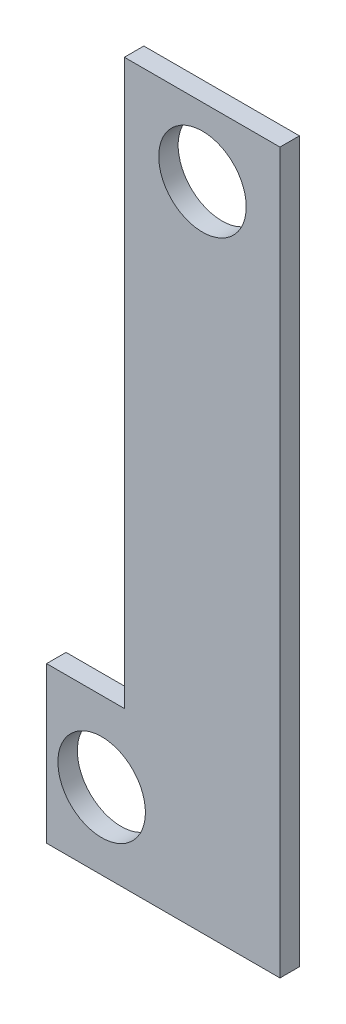
ISO-10303-21;
HEADER;
FILE_DESCRIPTION(('STEP AP214'),'2;1');
FILE_NAME('part.step','',(''),(''),'','','');
FILE_SCHEMA(('AUTOMOTIVE_DESIGN { 1 0 10303 214 1 1 1 1 }'));
ENDSEC;
DATA;
#1=APPLICATION_CONTEXT('core data for automotive mechanical design processes');
#2=APPLICATION_PROTOCOL_DEFINITION('international standard','automotive_design',2000,#1);
#3=PRODUCT_CONTEXT('',#1,'mechanical');
#4=PRODUCT('Part','Part','',(#3));
#5=PRODUCT_RELATED_PRODUCT_CATEGORY('part','',(#4));
#6=PRODUCT_DEFINITION_FORMATION('','',#4);
#7=PRODUCT_DEFINITION_CONTEXT('part definition',#1,'design');
#8=PRODUCT_DEFINITION('design','',#6,#7);
#9=PRODUCT_DEFINITION_SHAPE('','',#8);
#10=(LENGTH_UNIT() NAMED_UNIT(*) SI_UNIT(.MILLI.,.METRE.));
#11=(NAMED_UNIT(*) PLANE_ANGLE_UNIT() SI_UNIT($,.RADIAN.));
#12=(NAMED_UNIT(*) SI_UNIT($,.STERADIAN.) SOLID_ANGLE_UNIT());
#13=UNCERTAINTY_MEASURE_WITH_UNIT(LENGTH_MEASURE(1.E-05),#10,'distance_accuracy_value','');
#14=(GEOMETRIC_REPRESENTATION_CONTEXT(3) GLOBAL_UNCERTAINTY_ASSIGNED_CONTEXT((#13)) GLOBAL_UNIT_ASSIGNED_CONTEXT((#10,
#11,#12)) REPRESENTATION_CONTEXT('',''));
#15=CARTESIAN_POINT('',(0.,0.,0.));
#16=DIRECTION('',(0.,0.,1.));
#17=DIRECTION('',(1.,0.,0.));
#18=AXIS2_PLACEMENT_3D('',#15,#16,#17);
#19=CARTESIAN_POINT('',(76.2,0.,6.35));
#20=DIRECTION('',(-1.,0.,0.));
#21=DIRECTION('',(0.,0.,1.));
#22=AXIS2_PLACEMENT_3D('',#19,#20,#21);
#23=PLANE('',#22);
#24=DIRECTION('',(0.,1.,0.));
#25=VECTOR('',#24,1.);
#26=CARTESIAN_POINT('',(76.2,0.,0.));
#27=LINE('',#26,#25);
#28=CARTESIAN_POINT('',(76.2,0.,0.));
#29=VERTEX_POINT('',#28);
#30=CARTESIAN_POINT('',(76.2,234.95,0.));
#31=VERTEX_POINT('',#30);
#32=EDGE_CURVE('E125',#29,#31,#27,.T.);
#33=ORIENTED_EDGE('',*,*,#32,.T.);
#34=DIRECTION('',(0.,0.,-1.));
#35=VECTOR('',#34,1.);
#36=CARTESIAN_POINT('',(76.2,234.95,6.35));
#37=LINE('',#36,#35);
#38=CARTESIAN_POINT('',(76.2,234.95,6.35));
#39=VERTEX_POINT('',#38);
#40=EDGE_CURVE('E11',#39,#31,#37,.T.);
#41=ORIENTED_EDGE('',*,*,#40,.F.);
#42=DIRECTION('',(0.,1.,0.));
#43=VECTOR('',#42,1.);
#44=CARTESIAN_POINT('',(76.2,0.,6.35));
#45=LINE('',#44,#43);
#46=CARTESIAN_POINT('',(76.2,0.,6.35));
#47=VERTEX_POINT('',#46);
#48=EDGE_CURVE('E144',#47,#39,#45,.T.);
#49=ORIENTED_EDGE('',*,*,#48,.F.);
#50=DIRECTION('',(0.,0.,-1.));
#51=VECTOR('',#50,1.);
#52=CARTESIAN_POINT('',(76.2,0.,6.35));
#53=LINE('',#52,#51);
#54=EDGE_CURVE('E121',#47,#29,#53,.T.);
#55=ORIENTED_EDGE('',*,*,#54,.T.);
#56=EDGE_LOOP('',(#33,#41,#49,#55));
#57=FACE_BOUND('',#56,.T.);
#58=ADVANCED_FACE('F38',(#57),#23,.F.);
#59=CARTESIAN_POINT('',(76.2,234.95,6.35));
#60=DIRECTION('',(0.,-1.,0.));
#61=DIRECTION('',(0.,0.,-1.));
#62=AXIS2_PLACEMENT_3D('',#59,#60,#61);
#63=PLANE('',#62);
#64=DIRECTION('',(-1.,0.,0.));
#65=VECTOR('',#64,1.);
#66=CARTESIAN_POINT('',(76.2,234.95,0.));
#67=LINE('',#66,#65);
#68=CARTESIAN_POINT('',(25.4,234.95,0.));
#69=VERTEX_POINT('',#68);
#70=EDGE_CURVE('E129',#31,#69,#67,.T.);
#71=ORIENTED_EDGE('',*,*,#70,.T.);
#72=DIRECTION('',(0.,0.,-1.));
#73=VECTOR('',#72,1.);
#74=CARTESIAN_POINT('',(25.4,234.95,6.35));
#75=LINE('',#74,#73);
#76=CARTESIAN_POINT('',(25.4,234.95,6.35));
#77=VERTEX_POINT('',#76);
#78=EDGE_CURVE('E47',#77,#69,#75,.T.);
#79=ORIENTED_EDGE('',*,*,#78,.F.);
#80=DIRECTION('',(-1.,0.,0.));
#81=VECTOR('',#80,1.);
#82=CARTESIAN_POINT('',(76.2,234.95,6.35));
#83=LINE('',#82,#81);
#84=EDGE_CURVE('E88',#39,#77,#83,.T.);
#85=ORIENTED_EDGE('',*,*,#84,.F.);
#86=ORIENTED_EDGE('',*,*,#40,.T.);
#87=EDGE_LOOP('',(#71,#79,#85,#86));
#88=FACE_BOUND('',#87,.T.);
#89=ADVANCED_FACE('F174',(#88),#63,.F.);
#90=CARTESIAN_POINT('',(25.4,234.95,6.35));
#91=DIRECTION('',(1.,0.,0.));
#92=DIRECTION('',(0.,0.,-1.));
#93=AXIS2_PLACEMENT_3D('',#90,#91,#92);
#94=PLANE('',#93);
#95=DIRECTION('',(0.,-1.,0.));
#96=VECTOR('',#95,1.);
#97=CARTESIAN_POINT('',(25.4,234.95,0.));
#98=LINE('',#97,#96);
#99=CARTESIAN_POINT('',(25.4,50.8,0.));
#100=VERTEX_POINT('',#99);
#101=EDGE_CURVE('E133',#69,#100,#98,.T.);
#102=ORIENTED_EDGE('',*,*,#101,.T.);
#103=DIRECTION('',(0.,0.,-1.));
#104=VECTOR('',#103,1.);
#105=CARTESIAN_POINT('',(25.4,50.8,6.35));
#106=LINE('',#105,#104);
#107=CARTESIAN_POINT('',(25.4,50.8,6.35));
#108=VERTEX_POINT('',#107);
#109=EDGE_CURVE('E108',#108,#100,#106,.T.);
#110=ORIENTED_EDGE('',*,*,#109,.F.);
#111=DIRECTION('',(0.,-1.,0.));
#112=VECTOR('',#111,1.);
#113=CARTESIAN_POINT('',(25.4,234.95,6.35));
#114=LINE('',#113,#112);
#115=EDGE_CURVE('E113',#77,#108,#114,.T.);
#116=ORIENTED_EDGE('',*,*,#115,.F.);
#117=ORIENTED_EDGE('',*,*,#78,.T.);
#118=EDGE_LOOP('',(#102,#110,#116,#117));
#119=FACE_BOUND('',#118,.T.);
#120=ADVANCED_FACE('F154',(#119),#94,.F.);
#121=CARTESIAN_POINT('',(0.,50.8,6.35));
#122=DIRECTION('',(0.,1.,0.));
#123=DIRECTION('',(0.,0.,1.));
#124=AXIS2_PLACEMENT_3D('',#121,#122,#123);
#125=PLANE('',#124);
#126=DIRECTION('',(1.,0.,0.));
#127=VECTOR('',#126,1.);
#128=CARTESIAN_POINT('',(0.,50.8,0.));
#129=LINE('',#128,#127);
#130=CARTESIAN_POINT('',(0.,50.8,0.));
#131=VERTEX_POINT('',#130);
#132=EDGE_CURVE('E102',#131,#100,#129,.T.);
#133=ORIENTED_EDGE('',*,*,#132,.F.);
#134=DIRECTION('',(0.,0.,-1.));
#135=VECTOR('',#134,1.);
#136=CARTESIAN_POINT('',(0.,50.8,6.35));
#137=LINE('',#136,#135);
#138=CARTESIAN_POINT('',(0.,50.8,6.35));
#139=VERTEX_POINT('',#138);
#140=EDGE_CURVE('E97',#139,#131,#137,.T.);
#141=ORIENTED_EDGE('',*,*,#140,.F.);
#142=DIRECTION('',(1.,0.,0.));
#143=VECTOR('',#142,1.);
#144=CARTESIAN_POINT('',(0.,50.8,6.35));
#145=LINE('',#144,#143);
#146=EDGE_CURVE('E100',#139,#108,#145,.T.);
#147=ORIENTED_EDGE('',*,*,#146,.T.);
#148=ORIENTED_EDGE('',*,*,#109,.T.);
#149=EDGE_LOOP('',(#133,#141,#147,#148));
#150=FACE_BOUND('',#149,.T.);
#151=ADVANCED_FACE('F99',(#150),#125,.T.);
#152=CARTESIAN_POINT('',(0.,0.,6.35));
#153=DIRECTION('',(-1.,0.,0.));
#154=DIRECTION('',(0.,0.,1.));
#155=AXIS2_PLACEMENT_3D('',#152,#153,#154);
#156=PLANE('',#155);
#157=DIRECTION('',(0.,1.,0.));
#158=VECTOR('',#157,1.);
#159=CARTESIAN_POINT('',(0.,0.,0.));
#160=LINE('',#159,#158);
#161=CARTESIAN_POINT('',(0.,0.,0.));
#162=VERTEX_POINT('',#161);
#163=EDGE_CURVE('E139',#162,#131,#160,.T.);
#164=ORIENTED_EDGE('',*,*,#163,.F.);
#165=DIRECTION('',(0.,0.,-1.));
#166=VECTOR('',#165,1.);
#167=CARTESIAN_POINT('',(0.,0.,6.35));
#168=LINE('',#167,#166);
#169=CARTESIAN_POINT('',(0.,0.,6.35));
#170=VERTEX_POINT('',#169);
#171=EDGE_CURVE('E77',#170,#162,#168,.T.);
#172=ORIENTED_EDGE('',*,*,#171,.F.);
#173=DIRECTION('',(0.,1.,0.));
#174=VECTOR('',#173,1.);
#175=CARTESIAN_POINT('',(0.,0.,6.35));
#176=LINE('',#175,#174);
#177=EDGE_CURVE('E111',#170,#139,#176,.T.);
#178=ORIENTED_EDGE('',*,*,#177,.T.);
#179=ORIENTED_EDGE('',*,*,#140,.T.);
#180=EDGE_LOOP('',(#164,#172,#178,#179));
#181=FACE_BOUND('',#180,.T.);
#182=ADVANCED_FACE('F117',(#181),#156,.T.);
#183=CARTESIAN_POINT('',(0.,0.,6.35));
#184=DIRECTION('',(0.,1.,0.));
#185=DIRECTION('',(0.,0.,1.));
#186=AXIS2_PLACEMENT_3D('',#183,#184,#185);
#187=PLANE('',#186);
#188=DIRECTION('',(1.,0.,0.));
#189=VECTOR('',#188,1.);
#190=CARTESIAN_POINT('',(0.,0.,0.));
#191=LINE('',#190,#189);
#192=EDGE_CURVE('E80',#162,#29,#191,.T.);
#193=ORIENTED_EDGE('',*,*,#192,.T.);
#194=ORIENTED_EDGE('',*,*,#54,.F.);
#195=DIRECTION('',(1.,0.,0.));
#196=VECTOR('',#195,1.);
#197=CARTESIAN_POINT('',(0.,0.,6.35));
#198=LINE('',#197,#196);
#199=EDGE_CURVE('E55',#170,#47,#198,.T.);
#200=ORIENTED_EDGE('',*,*,#199,.F.);
#201=ORIENTED_EDGE('',*,*,#171,.T.);
#202=EDGE_LOOP('',(#193,#194,#200,#201));
#203=FACE_BOUND('',#202,.T.);
#204=ADVANCED_FACE('F161',(#203),#187,.F.);
#205=CARTESIAN_POINT('',(0.,0.,6.35));
#206=DIRECTION('',(0.,0.,1.));
#207=DIRECTION('',(1.,0.,0.));
#208=AXIS2_PLACEMENT_3D('',#205,#206,#207);
#209=PLANE('',#208);
#210=CARTESIAN_POINT('',(17.9824929589429,24.8496325734493,6.35));
#211=DIRECTION('',(0.,0.,1.));
#212=DIRECTION('',(1.,0.,0.));
#213=AXIS2_PLACEMENT_3D('',#210,#211,#212);
#214=CIRCLE('',#213,14.2875);
#215=CARTESIAN_POINT('',(32.2699929589429,24.8496325734493,6.35));
#216=VERTEX_POINT('',#215);
#217=EDGE_CURVE('E234',#216,#216,#214,.T.);
#218=ORIENTED_EDGE('',*,*,#217,.F.);
#219=EDGE_LOOP('',(#218));
#220=FACE_BOUND('',#219,.T.);
#221=CARTESIAN_POINT('',(50.8967852995355,212.524849318655,6.35));
#222=DIRECTION('',(0.,0.,1.));
#223=DIRECTION('',(1.,0.,0.));
#224=AXIS2_PLACEMENT_3D('',#221,#222,#223);
#225=CIRCLE('',#224,14.2875);
#226=CARTESIAN_POINT('',(65.1842852995354,212.524849318655,6.35));
#227=VERTEX_POINT('',#226);
#228=EDGE_CURVE('E242',#227,#227,#225,.T.);
#229=ORIENTED_EDGE('',*,*,#228,.F.);
#230=EDGE_LOOP('',(#229));
#231=FACE_BOUND('',#230,.T.);
#232=ORIENTED_EDGE('',*,*,#48,.T.);
#233=ORIENTED_EDGE('',*,*,#84,.T.);
#234=ORIENTED_EDGE('',*,*,#115,.T.);
#235=ORIENTED_EDGE('',*,*,#146,.F.);
#236=ORIENTED_EDGE('',*,*,#177,.F.);
#237=ORIENTED_EDGE('',*,*,#199,.T.);
#238=EDGE_LOOP('',(#232,#233,#234,#235,#236,#237));
#239=FACE_BOUND('',#238,.T.);
#240=ADVANCED_FACE('F110',(#220,#231,#239),#209,.T.);
#241=CARTESIAN_POINT('',(0.,0.,0.));
#242=DIRECTION('',(0.,0.,1.));
#243=DIRECTION('',(1.,0.,0.));
#244=AXIS2_PLACEMENT_3D('',#241,#242,#243);
#245=PLANE('',#244);
#246=CARTESIAN_POINT('',(17.9824929589429,24.8496325734493,0.));
#247=DIRECTION('',(0.,0.,1.));
#248=DIRECTION('',(1.,0.,0.));
#249=AXIS2_PLACEMENT_3D('',#246,#247,#248);
#250=CIRCLE('',#249,14.2875);
#251=CARTESIAN_POINT('',(32.2699929589429,24.8496325734493,0.));
#252=VERTEX_POINT('',#251);
#253=EDGE_CURVE('E130',#252,#252,#250,.T.);
#254=ORIENTED_EDGE('',*,*,#253,.T.);
#255=EDGE_LOOP('',(#254));
#256=FACE_BOUND('',#255,.T.);
#257=CARTESIAN_POINT('',(50.8967852995355,212.524849318655,0.));
#258=DIRECTION('',(0.,0.,1.));
#259=DIRECTION('',(1.,0.,0.));
#260=AXIS2_PLACEMENT_3D('',#257,#258,#259);
#261=CIRCLE('',#260,14.2875);
#262=CARTESIAN_POINT('',(65.1842852995354,212.524849318655,0.));
#263=VERTEX_POINT('',#262);
#264=EDGE_CURVE('E236',#263,#263,#261,.T.);
#265=ORIENTED_EDGE('',*,*,#264,.T.);
#266=EDGE_LOOP('',(#265));
#267=FACE_BOUND('',#266,.T.);
#268=ORIENTED_EDGE('',*,*,#32,.F.);
#269=ORIENTED_EDGE('',*,*,#192,.F.);
#270=ORIENTED_EDGE('',*,*,#163,.T.);
#271=ORIENTED_EDGE('',*,*,#132,.T.);
#272=ORIENTED_EDGE('',*,*,#101,.F.);
#273=ORIENTED_EDGE('',*,*,#70,.F.);
#274=EDGE_LOOP('',(#268,#269,#270,#271,#272,#273));
#275=FACE_BOUND('',#274,.T.);
#276=ADVANCED_FACE('F157',(#256,#267,#275),#245,.F.);
#277=CARTESIAN_POINT('',(50.8967852995355,212.524849318655,0.));
#278=DIRECTION('',(0.,0.,1.));
#279=DIRECTION('',(1.,0.,0.));
#280=AXIS2_PLACEMENT_3D('',#277,#278,#279);
#281=CYLINDRICAL_SURFACE('',#280,14.2875);
#282=ORIENTED_EDGE('',*,*,#264,.F.);
#283=EDGE_LOOP('',(#282));
#284=FACE_BOUND('',#283,.T.);
#285=ORIENTED_EDGE('',*,*,#228,.T.);
#286=EDGE_LOOP('',(#285));
#287=FACE_BOUND('',#286,.T.);
#288=ADVANCED_FACE('F207',(#284,#287),#281,.F.);
#289=CARTESIAN_POINT('',(17.9824929589429,24.8496325734493,0.));
#290=DIRECTION('',(0.,0.,1.));
#291=DIRECTION('',(1.,0.,0.));
#292=AXIS2_PLACEMENT_3D('',#289,#290,#291);
#293=CYLINDRICAL_SURFACE('',#292,14.2875);
#294=ORIENTED_EDGE('',*,*,#253,.F.);
#295=EDGE_LOOP('',(#294));
#296=FACE_BOUND('',#295,.T.);
#297=ORIENTED_EDGE('',*,*,#217,.T.);
#298=EDGE_LOOP('',(#297));
#299=FACE_BOUND('',#298,.T.);
#300=ADVANCED_FACE('F215',(#296,#299),#293,.F.);
#301=CLOSED_SHELL('',(#58,#89,#120,#151,#182,#204,#240,#276,#288,#300));
#302=MANIFOLD_SOLID_BREP('B2',#301);
#303=ADVANCED_BREP_SHAPE_REPRESENTATION('',(#18,#302),#14);
#304=SHAPE_DEFINITION_REPRESENTATION(#9,#303);
ENDSEC;
END-ISO-10303-21;
